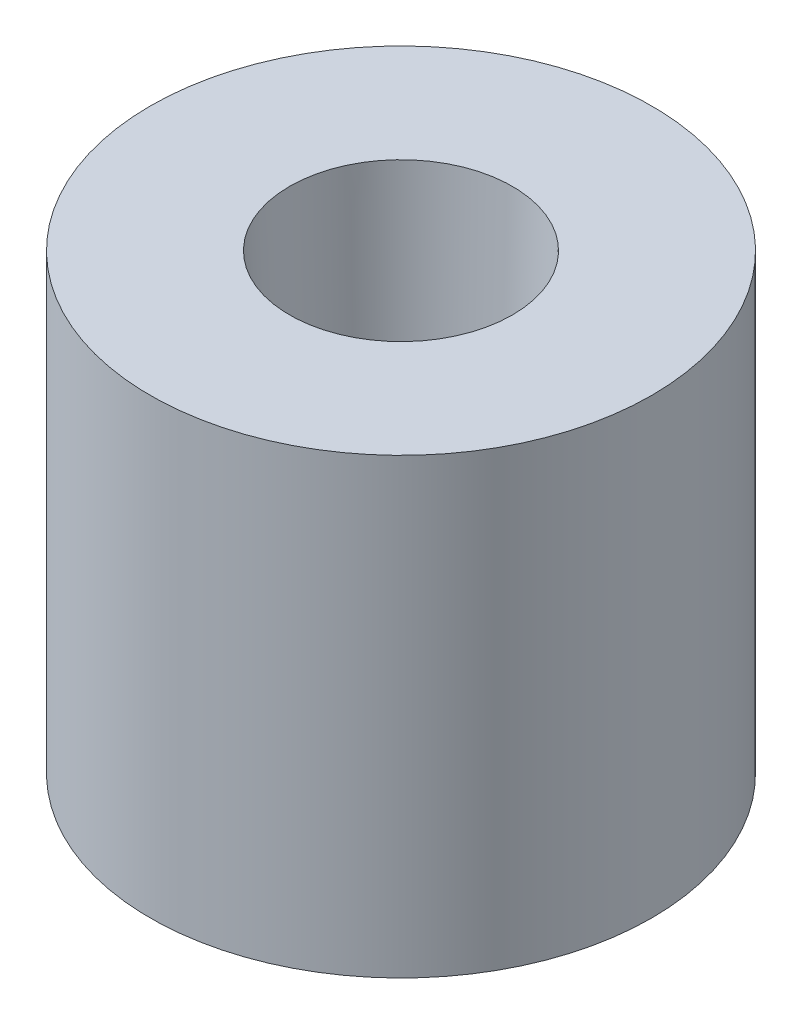
ISO-10303-21;
HEADER;
FILE_DESCRIPTION(('STEP AP214'),'2;1');
FILE_NAME('part.step','',(''),(''),'','','');
FILE_SCHEMA(('AUTOMOTIVE_DESIGN { 1 0 10303 214 1 1 1 1 }'));
ENDSEC;
DATA;
#1=APPLICATION_CONTEXT('core data for automotive mechanical design processes');
#2=APPLICATION_PROTOCOL_DEFINITION('international standard','automotive_design',2000,#1);
#3=PRODUCT_CONTEXT('',#1,'mechanical');
#4=PRODUCT('Part','Part','',(#3));
#5=PRODUCT_RELATED_PRODUCT_CATEGORY('part','',(#4));
#6=PRODUCT_DEFINITION_FORMATION('','',#4);
#7=PRODUCT_DEFINITION_CONTEXT('part definition',#1,'design');
#8=PRODUCT_DEFINITION('design','',#6,#7);
#9=PRODUCT_DEFINITION_SHAPE('','',#8);
#10=(LENGTH_UNIT() NAMED_UNIT(*) SI_UNIT(.MILLI.,.METRE.));
#11=(NAMED_UNIT(*) PLANE_ANGLE_UNIT() SI_UNIT($,.RADIAN.));
#12=(NAMED_UNIT(*) SI_UNIT($,.STERADIAN.) SOLID_ANGLE_UNIT());
#13=UNCERTAINTY_MEASURE_WITH_UNIT(LENGTH_MEASURE(1.E-05),#10,'distance_accuracy_value','');
#14=(GEOMETRIC_REPRESENTATION_CONTEXT(3) GLOBAL_UNCERTAINTY_ASSIGNED_CONTEXT((#13)) GLOBAL_UNIT_ASSIGNED_CONTEXT((#10,
#11,#12)) REPRESENTATION_CONTEXT('',''));
#15=CARTESIAN_POINT('',(0.,0.,0.));
#16=DIRECTION('',(0.,0.,1.));
#17=DIRECTION('',(1.,0.,0.));
#18=AXIS2_PLACEMENT_3D('',#15,#16,#17);
#19=CARTESIAN_POINT('',(0.,0.,0.));
#20=DIRECTION('',(0.,-1.,0.));
#21=DIRECTION('',(1.,0.,0.));
#22=AXIS2_PLACEMENT_3D('',#19,#20,#21);
#23=PLANE('',#22);
#24=CARTESIAN_POINT('',(0.,0.,0.));
#25=DIRECTION('',(0.,1.,0.));
#26=DIRECTION('',(-1.,0.,0.));
#27=AXIS2_PLACEMENT_3D('',#24,#25,#26);
#28=CIRCLE('',#27,3.6);
#29=CARTESIAN_POINT('',(-3.6,0.,0.));
#30=VERTEX_POINT('',#29);
#31=EDGE_CURVE('E10',#30,#30,#28,.T.);
#32=ORIENTED_EDGE('',*,*,#31,.F.);
#33=EDGE_LOOP('',(#32));
#34=FACE_BOUND('',#33,.T.);
#35=ADVANCED_FACE('F32',(#34),#23,.T.);
#36=CARTESIAN_POINT('',(0.,1.5,0.));
#37=DIRECTION('',(0.,1.,0.));
#38=DIRECTION('',(-1.,0.,0.));
#39=AXIS2_PLACEMENT_3D('',#36,#37,#38);
#40=CYLINDRICAL_SURFACE('',#39,3.6);
#41=ORIENTED_EDGE('',*,*,#31,.T.);
#42=EDGE_LOOP('',(#41));
#43=FACE_BOUND('',#42,.T.);
#44=CARTESIAN_POINT('',(0.,6.5,0.));
#45=DIRECTION('',(0.,1.,0.));
#46=DIRECTION('',(-1.,0.,0.));
#47=AXIS2_PLACEMENT_3D('',#44,#45,#46);
#48=CIRCLE('',#47,3.6);
#49=CARTESIAN_POINT('',(-3.6,6.5,0.));
#50=VERTEX_POINT('',#49);
#51=EDGE_CURVE('E38',#50,#50,#48,.T.);
#52=ORIENTED_EDGE('',*,*,#51,.F.);
#53=EDGE_LOOP('',(#52));
#54=FACE_BOUND('',#53,.T.);
#55=ADVANCED_FACE('F64',(#43,#54),#40,.T.);
#56=CARTESIAN_POINT('',(-3.6,6.5,0.));
#57=DIRECTION('',(0.,1.,0.));
#58=DIRECTION('',(-1.,0.,0.));
#59=AXIS2_PLACEMENT_3D('',#56,#57,#58);
#60=PLANE('',#59);
#61=ORIENTED_EDGE('',*,*,#51,.T.);
#62=EDGE_LOOP('',(#61));
#63=FACE_BOUND('',#62,.T.);
#64=CARTESIAN_POINT('',(0.,6.5,0.));
#65=DIRECTION('',(0.,1.,0.));
#66=DIRECTION('',(-1.,0.,0.));
#67=AXIS2_PLACEMENT_3D('',#64,#65,#66);
#68=CIRCLE('',#67,1.6);
#69=CARTESIAN_POINT('',(-1.6,6.5,0.));
#70=VERTEX_POINT('',#69);
#71=EDGE_CURVE('E42',#70,#70,#68,.T.);
#72=ORIENTED_EDGE('',*,*,#71,.F.);
#73=EDGE_LOOP('',(#72));
#74=FACE_BOUND('',#73,.T.);
#75=ADVANCED_FACE('F56',(#63,#74),#60,.T.);
#76=CARTESIAN_POINT('',(0.,1.5,0.));
#77=DIRECTION('',(0.,1.,0.));
#78=DIRECTION('',(-1.,0.,0.));
#79=AXIS2_PLACEMENT_3D('',#76,#77,#78);
#80=CONICAL_SURFACE('',#79,1.43,0.0339869077462551);
#81=ORIENTED_EDGE('',*,*,#71,.T.);
#82=EDGE_LOOP('',(#81));
#83=FACE_BOUND('',#82,.T.);
#84=CARTESIAN_POINT('',(0.,1.5,0.));
#85=DIRECTION('',(0.,1.,0.));
#86=DIRECTION('',(-1.,0.,0.));
#87=AXIS2_PLACEMENT_3D('',#84,#85,#86);
#88=CIRCLE('',#87,1.43);
#89=CARTESIAN_POINT('',(-1.43,1.5,0.));
#90=VERTEX_POINT('',#89);
#91=EDGE_CURVE('E46',#90,#90,#88,.T.);
#92=ORIENTED_EDGE('',*,*,#91,.F.);
#93=EDGE_LOOP('',(#92));
#94=FACE_BOUND('',#93,.T.);
#95=ADVANCED_FACE('F54',(#83,#94),#80,.F.);
#96=CARTESIAN_POINT('',(-1.43,1.5,0.));
#97=DIRECTION('',(0.,1.,0.));
#98=DIRECTION('',(-1.,0.,0.));
#99=AXIS2_PLACEMENT_3D('',#96,#97,#98);
#100=PLANE('',#99);
#101=ORIENTED_EDGE('',*,*,#91,.T.);
#102=EDGE_LOOP('',(#101));
#103=FACE_BOUND('',#102,.T.);
#104=ADVANCED_FACE('F52',(#103),#100,.T.);
#105=CLOSED_SHELL('',(#35,#55,#75,#95,#104));
#106=MANIFOLD_SOLID_BREP('B2',#105);
#107=ADVANCED_BREP_SHAPE_REPRESENTATION('',(#18,#106),#14);
#108=SHAPE_DEFINITION_REPRESENTATION(#9,#107);
ENDSEC;
END-ISO-10303-21;
